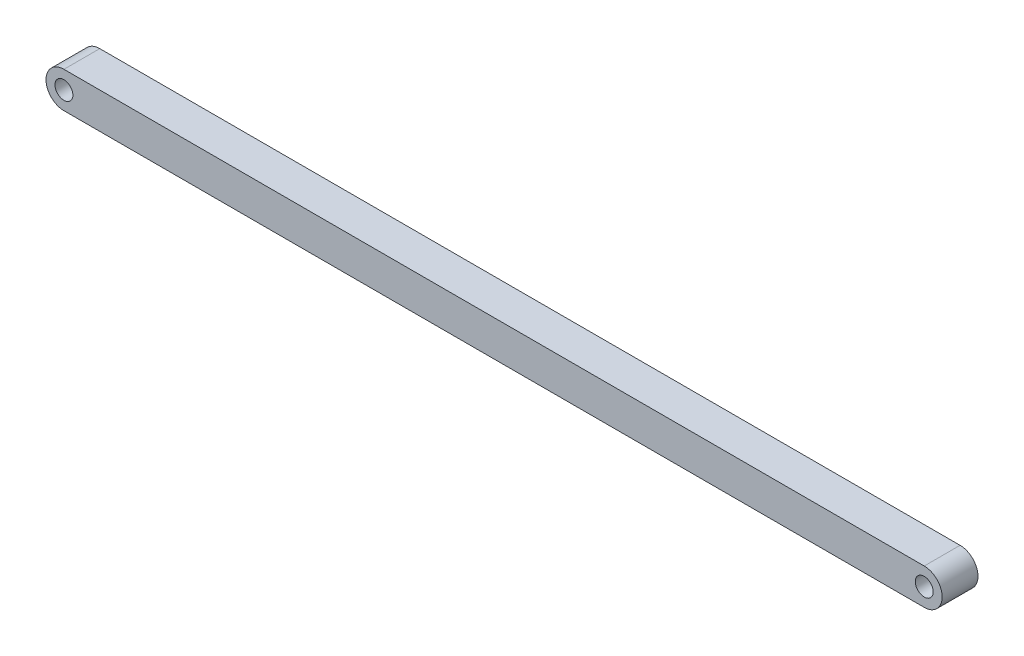
ISO-10303-21;
HEADER;
FILE_DESCRIPTION(('STEP AP214'),'2;1');
FILE_NAME('part.step','',(''),(''),'','','');
FILE_SCHEMA(('AUTOMOTIVE_DESIGN { 1 0 10303 214 1 1 1 1 }'));
ENDSEC;
DATA;
#1=APPLICATION_CONTEXT('core data for automotive mechanical design processes');
#2=APPLICATION_PROTOCOL_DEFINITION('international standard','automotive_design',2000,#1);
#3=PRODUCT_CONTEXT('',#1,'mechanical');
#4=PRODUCT('Part','Part','',(#3));
#5=PRODUCT_RELATED_PRODUCT_CATEGORY('part','',(#4));
#6=PRODUCT_DEFINITION_FORMATION('','',#4);
#7=PRODUCT_DEFINITION_CONTEXT('part definition',#1,'design');
#8=PRODUCT_DEFINITION('design','',#6,#7);
#9=PRODUCT_DEFINITION_SHAPE('','',#8);
#10=(LENGTH_UNIT() NAMED_UNIT(*) SI_UNIT(.MILLI.,.METRE.));
#11=(NAMED_UNIT(*) PLANE_ANGLE_UNIT() SI_UNIT($,.RADIAN.));
#12=(NAMED_UNIT(*) SI_UNIT($,.STERADIAN.) SOLID_ANGLE_UNIT());
#13=UNCERTAINTY_MEASURE_WITH_UNIT(LENGTH_MEASURE(1.E-05),#10,'distance_accuracy_value','');
#14=(GEOMETRIC_REPRESENTATION_CONTEXT(3) GLOBAL_UNCERTAINTY_ASSIGNED_CONTEXT((#13)) GLOBAL_UNIT_ASSIGNED_CONTEXT((#10,
#11,#12)) REPRESENTATION_CONTEXT('',''));
#15=CARTESIAN_POINT('',(0.,0.,0.));
#16=DIRECTION('',(0.,0.,1.));
#17=DIRECTION('',(1.,0.,0.));
#18=AXIS2_PLACEMENT_3D('',#15,#16,#17);
#19=CARTESIAN_POINT('',(-304.8,0.,12.7));
#20=DIRECTION('',(0.,0.,-1.));
#21=DIRECTION('',(-1.,0.,0.));
#22=AXIS2_PLACEMENT_3D('',#19,#20,#21);
#23=CYLINDRICAL_SURFACE('',#22,12.7);
#24=CARTESIAN_POINT('',(-304.8,0.,-12.7));
#25=DIRECTION('',(0.,0.,1.));
#26=DIRECTION('',(1.,0.,0.));
#27=AXIS2_PLACEMENT_3D('',#24,#25,#26);
#28=CIRCLE('',#27,12.7);
#29=CARTESIAN_POINT('',(-304.8,12.7,-12.7));
#30=VERTEX_POINT('',#29);
#31=CARTESIAN_POINT('',(-304.8,-12.7,-12.7));
#32=VERTEX_POINT('',#31);
#33=EDGE_CURVE('E99',#30,#32,#28,.T.);
#34=ORIENTED_EDGE('',*,*,#33,.T.);
#35=DIRECTION('',(0.,0.,-1.));
#36=VECTOR('',#35,1.);
#37=CARTESIAN_POINT('',(-304.8,-12.7,12.7));
#38=LINE('',#37,#36);
#39=CARTESIAN_POINT('',(-304.8,-12.7,12.7));
#40=VERTEX_POINT('',#39);
#41=EDGE_CURVE('E11',#40,#32,#38,.T.);
#42=ORIENTED_EDGE('',*,*,#41,.F.);
#43=CARTESIAN_POINT('',(-304.8,0.,12.7));
#44=DIRECTION('',(0.,0.,1.));
#45=DIRECTION('',(1.,0.,0.));
#46=AXIS2_PLACEMENT_3D('',#43,#44,#45);
#47=CIRCLE('',#46,12.7);
#48=CARTESIAN_POINT('',(-304.8,12.7,12.7));
#49=VERTEX_POINT('',#48);
#50=EDGE_CURVE('E87',#49,#40,#47,.T.);
#51=ORIENTED_EDGE('',*,*,#50,.F.);
#52=DIRECTION('',(0.,0.,-1.));
#53=VECTOR('',#52,1.);
#54=CARTESIAN_POINT('',(-304.8,12.7,12.7));
#55=LINE('',#54,#53);
#56=EDGE_CURVE('E95',#49,#30,#55,.T.);
#57=ORIENTED_EDGE('',*,*,#56,.T.);
#58=EDGE_LOOP('',(#34,#42,#51,#57));
#59=FACE_BOUND('',#58,.T.);
#60=ADVANCED_FACE('F36',(#59),#23,.T.);
#61=CARTESIAN_POINT('',(-304.8,-12.7,12.7));
#62=DIRECTION('',(0.,1.,0.));
#63=DIRECTION('',(-1.,0.,0.));
#64=AXIS2_PLACEMENT_3D('',#61,#62,#63);
#65=PLANE('',#64);
#66=DIRECTION('',(1.,0.,0.));
#67=VECTOR('',#66,1.);
#68=CARTESIAN_POINT('',(-304.8,-12.7,-12.7));
#69=LINE('',#68,#67);
#70=CARTESIAN_POINT('',(304.8,-12.6999999999999,-12.7));
#71=VERTEX_POINT('',#70);
#72=EDGE_CURVE('E91',#32,#71,#69,.T.);
#73=ORIENTED_EDGE('',*,*,#72,.T.);
#74=DIRECTION('',(0.,0.,-1.));
#75=VECTOR('',#74,1.);
#76=CARTESIAN_POINT('',(304.8,-12.6999999999999,12.7));
#77=LINE('',#76,#75);
#78=CARTESIAN_POINT('',(304.8,-12.6999999999999,12.7));
#79=VERTEX_POINT('',#78);
#80=EDGE_CURVE('E44',#79,#71,#77,.T.);
#81=ORIENTED_EDGE('',*,*,#80,.F.);
#82=DIRECTION('',(1.,0.,0.));
#83=VECTOR('',#82,1.);
#84=CARTESIAN_POINT('',(-304.8,-12.7,12.7));
#85=LINE('',#84,#83);
#86=EDGE_CURVE('E82',#40,#79,#85,.T.);
#87=ORIENTED_EDGE('',*,*,#86,.F.);
#88=ORIENTED_EDGE('',*,*,#41,.T.);
#89=EDGE_LOOP('',(#73,#81,#87,#88));
#90=FACE_BOUND('',#89,.T.);
#91=ADVANCED_FACE('F90',(#90),#65,.F.);
#92=CARTESIAN_POINT('',(304.8,1.11981703314034E-13,12.7));
#93=DIRECTION('',(0.,0.,-1.));
#94=DIRECTION('',(-1.,0.,0.));
#95=AXIS2_PLACEMENT_3D('',#92,#93,#94);
#96=CYLINDRICAL_SURFACE('',#95,12.7);
#97=CARTESIAN_POINT('',(304.8,1.11981703314034E-13,-12.7));
#98=DIRECTION('',(0.,0.,1.));
#99=DIRECTION('',(1.,0.,0.));
#100=AXIS2_PLACEMENT_3D('',#97,#98,#99);
#101=CIRCLE('',#100,12.7);
#102=CARTESIAN_POINT('',(304.8,12.7000000000001,-12.7));
#103=VERTEX_POINT('',#102);
#104=EDGE_CURVE('E69',#71,#103,#101,.T.);
#105=ORIENTED_EDGE('',*,*,#104,.T.);
#106=DIRECTION('',(0.,0.,-1.));
#107=VECTOR('',#106,1.);
#108=CARTESIAN_POINT('',(304.8,12.7000000000001,12.7));
#109=LINE('',#108,#107);
#110=CARTESIAN_POINT('',(304.8,12.7000000000001,12.7));
#111=VERTEX_POINT('',#110);
#112=EDGE_CURVE('E92',#111,#103,#109,.T.);
#113=ORIENTED_EDGE('',*,*,#112,.F.);
#114=CARTESIAN_POINT('',(304.8,1.11981703314034E-13,12.7));
#115=DIRECTION('',(0.,0.,1.));
#116=DIRECTION('',(1.,0.,0.));
#117=AXIS2_PLACEMENT_3D('',#114,#115,#116);
#118=CIRCLE('',#117,12.7);
#119=EDGE_CURVE('E85',#79,#111,#118,.T.);
#120=ORIENTED_EDGE('',*,*,#119,.F.);
#121=ORIENTED_EDGE('',*,*,#80,.T.);
#122=EDGE_LOOP('',(#105,#113,#120,#121));
#123=FACE_BOUND('',#122,.T.);
#124=ADVANCED_FACE('F93',(#123),#96,.T.);
#125=CARTESIAN_POINT('',(-304.8,12.7,12.7));
#126=DIRECTION('',(0.,-1.,0.));
#127=DIRECTION('',(1.,0.,0.));
#128=AXIS2_PLACEMENT_3D('',#125,#126,#127);
#129=PLANE('',#128);
#130=DIRECTION('',(-1.,0.,0.));
#131=VECTOR('',#130,1.);
#132=CARTESIAN_POINT('',(-304.8,12.7,-12.7));
#133=LINE('',#132,#131);
#134=EDGE_CURVE('E75',#103,#30,#133,.T.);
#135=ORIENTED_EDGE('',*,*,#134,.T.);
#136=ORIENTED_EDGE('',*,*,#56,.F.);
#137=DIRECTION('',(-1.,0.,0.));
#138=VECTOR('',#137,1.);
#139=CARTESIAN_POINT('',(-304.8,12.7,12.7));
#140=LINE('',#139,#138);
#141=EDGE_CURVE('E52',#111,#49,#140,.T.);
#142=ORIENTED_EDGE('',*,*,#141,.F.);
#143=ORIENTED_EDGE('',*,*,#112,.T.);
#144=EDGE_LOOP('',(#135,#136,#142,#143));
#145=FACE_BOUND('',#144,.T.);
#146=ADVANCED_FACE('F107',(#145),#129,.F.);
#147=CARTESIAN_POINT('',(-304.8,0.,12.7));
#148=DIRECTION('',(0.,0.,1.));
#149=DIRECTION('',(1.,0.,0.));
#150=AXIS2_PLACEMENT_3D('',#147,#148,#149);
#151=PLANE('',#150);
#152=CARTESIAN_POINT('',(304.8,1.11981703314034E-13,12.7));
#153=DIRECTION('',(0.,0.,1.));
#154=DIRECTION('',(1.,0.,0.));
#155=AXIS2_PLACEMENT_3D('',#152,#153,#154);
#156=CIRCLE('',#155,6.34999999999999);
#157=CARTESIAN_POINT('',(311.15,1.11981703314034E-13,12.7));
#158=VERTEX_POINT('',#157);
#159=EDGE_CURVE('E119',#158,#158,#156,.T.);
#160=ORIENTED_EDGE('',*,*,#159,.F.);
#161=EDGE_LOOP('',(#160));
#162=FACE_BOUND('',#161,.T.);
#163=CARTESIAN_POINT('',(-304.8,0.,12.7));
#164=DIRECTION('',(0.,0.,1.));
#165=DIRECTION('',(1.,0.,0.));
#166=AXIS2_PLACEMENT_3D('',#163,#164,#165);
#167=CIRCLE('',#166,6.34999999999999);
#168=CARTESIAN_POINT('',(-298.45,0.,12.7));
#169=VERTEX_POINT('',#168);
#170=EDGE_CURVE('E113',#169,#169,#167,.T.);
#171=ORIENTED_EDGE('',*,*,#170,.F.);
#172=EDGE_LOOP('',(#171));
#173=FACE_BOUND('',#172,.T.);
#174=ORIENTED_EDGE('',*,*,#50,.T.);
#175=ORIENTED_EDGE('',*,*,#86,.T.);
#176=ORIENTED_EDGE('',*,*,#119,.T.);
#177=ORIENTED_EDGE('',*,*,#141,.T.);
#178=EDGE_LOOP('',(#174,#175,#176,#177));
#179=FACE_BOUND('',#178,.T.);
#180=ADVANCED_FACE('F83',(#162,#173,#179),#151,.T.);
#181=CARTESIAN_POINT('',(-304.8,0.,-12.7));
#182=DIRECTION('',(0.,0.,1.));
#183=DIRECTION('',(1.,0.,0.));
#184=AXIS2_PLACEMENT_3D('',#181,#182,#183);
#185=PLANE('',#184);
#186=CARTESIAN_POINT('',(304.8,1.11981703314034E-13,-12.7));
#187=DIRECTION('',(0.,0.,1.));
#188=DIRECTION('',(1.,0.,0.));
#189=AXIS2_PLACEMENT_3D('',#186,#187,#188);
#190=CIRCLE('',#189,6.34999999999999);
#191=CARTESIAN_POINT('',(311.15,1.11981703314034E-13,-12.7));
#192=VERTEX_POINT('',#191);
#193=EDGE_CURVE('E116',#192,#192,#190,.T.);
#194=ORIENTED_EDGE('',*,*,#193,.T.);
#195=EDGE_LOOP('',(#194));
#196=FACE_BOUND('',#195,.T.);
#197=CARTESIAN_POINT('',(-304.8,0.,-12.7));
#198=DIRECTION('',(0.,0.,1.));
#199=DIRECTION('',(1.,0.,0.));
#200=AXIS2_PLACEMENT_3D('',#197,#198,#199);
#201=CIRCLE('',#200,6.34999999999999);
#202=CARTESIAN_POINT('',(-298.45,0.,-12.7));
#203=VERTEX_POINT('',#202);
#204=EDGE_CURVE('E102',#203,#203,#201,.T.);
#205=ORIENTED_EDGE('',*,*,#204,.T.);
#206=EDGE_LOOP('',(#205));
#207=FACE_BOUND('',#206,.T.);
#208=ORIENTED_EDGE('',*,*,#33,.F.);
#209=ORIENTED_EDGE('',*,*,#134,.F.);
#210=ORIENTED_EDGE('',*,*,#104,.F.);
#211=ORIENTED_EDGE('',*,*,#72,.F.);
#212=EDGE_LOOP('',(#208,#209,#210,#211));
#213=FACE_BOUND('',#212,.T.);
#214=ADVANCED_FACE('F110',(#196,#207,#213),#185,.F.);
#215=CARTESIAN_POINT('',(-304.8,0.,-12.7));
#216=DIRECTION('',(0.,0.,1.));
#217=DIRECTION('',(1.,0.,0.));
#218=AXIS2_PLACEMENT_3D('',#215,#216,#217);
#219=CYLINDRICAL_SURFACE('',#218,6.34999999999999);
#220=ORIENTED_EDGE('',*,*,#204,.F.);
#221=EDGE_LOOP('',(#220));
#222=FACE_BOUND('',#221,.T.);
#223=ORIENTED_EDGE('',*,*,#170,.T.);
#224=EDGE_LOOP('',(#223));
#225=FACE_BOUND('',#224,.T.);
#226=ADVANCED_FACE('F130',(#222,#225),#219,.F.);
#227=CARTESIAN_POINT('',(304.8,1.11981703314034E-13,-12.7));
#228=DIRECTION('',(0.,0.,1.));
#229=DIRECTION('',(1.,0.,0.));
#230=AXIS2_PLACEMENT_3D('',#227,#228,#229);
#231=CYLINDRICAL_SURFACE('',#230,6.34999999999999);
#232=ORIENTED_EDGE('',*,*,#193,.F.);
#233=EDGE_LOOP('',(#232));
#234=FACE_BOUND('',#233,.T.);
#235=ORIENTED_EDGE('',*,*,#159,.T.);
#236=EDGE_LOOP('',(#235));
#237=FACE_BOUND('',#236,.T.);
#238=ADVANCED_FACE('F127',(#234,#237),#231,.F.);
#239=CLOSED_SHELL('',(#60,#91,#124,#146,#180,#214,#226,#238));
#240=MANIFOLD_SOLID_BREP('B2',#239);
#241=ADVANCED_BREP_SHAPE_REPRESENTATION('',(#18,#240),#14);
#242=SHAPE_DEFINITION_REPRESENTATION(#9,#241);
ENDSEC;
END-ISO-10303-21;
